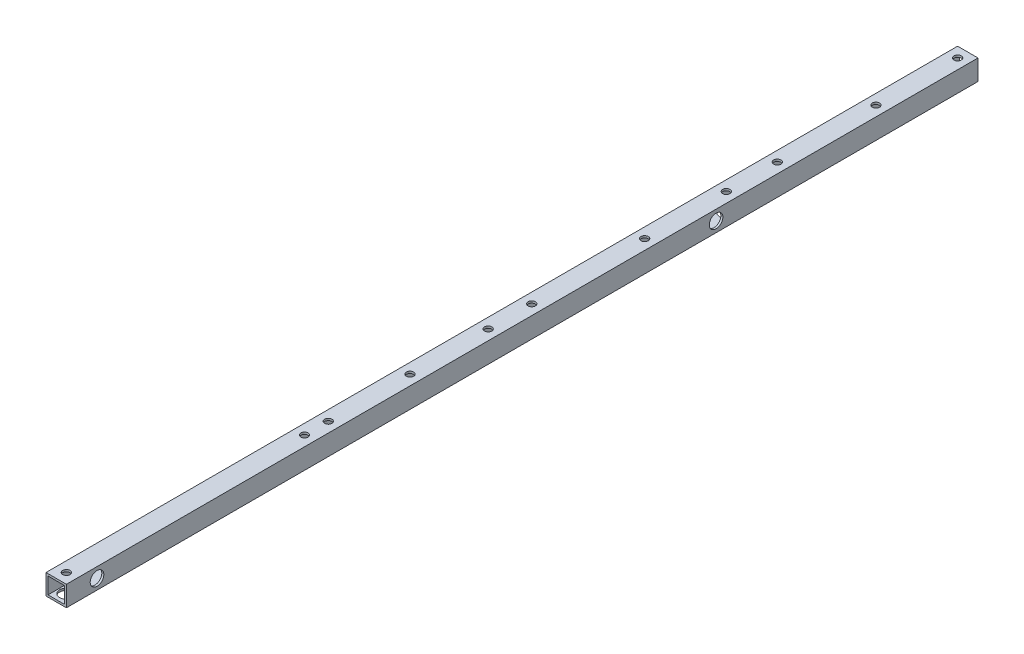
ISO-10303-21;
HEADER;
FILE_DESCRIPTION(('STEP AP214'),'2;1');
FILE_NAME('part.step','',(''),(''),'','','');
FILE_SCHEMA(('AUTOMOTIVE_DESIGN { 1 0 10303 214 1 1 1 1 }'));
ENDSEC;
DATA;
#1=APPLICATION_CONTEXT('core data for automotive mechanical design processes');
#2=APPLICATION_PROTOCOL_DEFINITION('international standard','automotive_design',2000,#1);
#3=PRODUCT_CONTEXT('',#1,'mechanical');
#4=PRODUCT('Part','Part','',(#3));
#5=PRODUCT_RELATED_PRODUCT_CATEGORY('part','',(#4));
#6=PRODUCT_DEFINITION_FORMATION('','',#4);
#7=PRODUCT_DEFINITION_CONTEXT('part definition',#1,'design');
#8=PRODUCT_DEFINITION('design','',#6,#7);
#9=PRODUCT_DEFINITION_SHAPE('','',#8);
#10=(LENGTH_UNIT() NAMED_UNIT(*) SI_UNIT(.MILLI.,.METRE.));
#11=(NAMED_UNIT(*) PLANE_ANGLE_UNIT() SI_UNIT($,.RADIAN.));
#12=(NAMED_UNIT(*) SI_UNIT($,.STERADIAN.) SOLID_ANGLE_UNIT());
#13=UNCERTAINTY_MEASURE_WITH_UNIT(LENGTH_MEASURE(1.E-05),#10,'distance_accuracy_value','');
#14=(GEOMETRIC_REPRESENTATION_CONTEXT(3) GLOBAL_UNCERTAINTY_ASSIGNED_CONTEXT((#13)) GLOBAL_UNIT_ASSIGNED_CONTEXT((#10,
#11,#12)) REPRESENTATION_CONTEXT('',''));
#15=CARTESIAN_POINT('',(0.,0.,0.));
#16=DIRECTION('',(0.,0.,1.));
#17=DIRECTION('',(1.,0.,0.));
#18=AXIS2_PLACEMENT_3D('',#15,#16,#17);
#19=CARTESIAN_POINT('',(-6.,-6.,670.));
#20=DIRECTION('',(0.,1.,0.));
#21=DIRECTION('',(0.,0.,1.));
#22=AXIS2_PLACEMENT_3D('',#19,#20,#21);
#23=PLANE('',#22);
#24=DIRECTION('',(1.,0.,0.));
#25=VECTOR('',#24,1.);
#26=CARTESIAN_POINT('',(-6.,-6.,0.));
#27=LINE('',#26,#25);
#28=CARTESIAN_POINT('',(-6.,-6.,0.));
#29=VERTEX_POINT('',#28);
#30=CARTESIAN_POINT('',(6.,-6.,0.));
#31=VERTEX_POINT('',#30);
#32=EDGE_CURVE('E117',#29,#31,#27,.T.);
#33=ORIENTED_EDGE('',*,*,#32,.F.);
#34=DIRECTION('',(0.,0.,-1.));
#35=VECTOR('',#34,1.);
#36=CARTESIAN_POINT('',(-6.,-6.,670.));
#37=LINE('',#36,#35);
#38=CARTESIAN_POINT('',(-6.,-6.,670.));
#39=VERTEX_POINT('',#38);
#40=EDGE_CURVE('E58',#39,#29,#37,.T.);
#41=ORIENTED_EDGE('',*,*,#40,.F.);
#42=DIRECTION('',(1.,0.,0.));
#43=VECTOR('',#42,1.);
#44=CARTESIAN_POINT('',(-6.,-6.,670.));
#45=LINE('',#44,#43);
#46=CARTESIAN_POINT('',(6.,-6.,670.));
#47=VERTEX_POINT('',#46);
#48=EDGE_CURVE('E131',#39,#47,#45,.T.);
#49=ORIENTED_EDGE('',*,*,#48,.T.);
#50=DIRECTION('',(0.,0.,-1.));
#51=VECTOR('',#50,1.);
#52=CARTESIAN_POINT('',(6.,-6.,670.));
#53=LINE('',#52,#51);
#54=EDGE_CURVE('E112',#47,#31,#53,.T.);
#55=ORIENTED_EDGE('',*,*,#54,.T.);
#56=EDGE_LOOP('',(#33,#41,#49,#55));
#57=FACE_BOUND('',#56,.T.);
#58=CARTESIAN_POINT('',(1.50911831337965E-12,-6.,67.4999999999999));
#59=DIRECTION('',(0.,1.,0.));
#60=DIRECTION('',(0.,0.,1.));
#61=AXIS2_PLACEMENT_3D('',#58,#59,#60);
#62=CIRCLE('',#61,5.);
#63=CARTESIAN_POINT('',(1.50911831337965E-12,-6.,72.5));
#64=VERTEX_POINT('',#63);
#65=EDGE_CURVE('E180',#64,#64,#62,.T.);
#66=ORIENTED_EDGE('',*,*,#65,.F.);
#67=EDGE_LOOP('',(#66));
#68=FACE_BOUND('',#67,.T.);
#69=CARTESIAN_POINT('',(0.,-6.,487.5));
#70=DIRECTION('',(0.,1.,0.));
#71=DIRECTION('',(0.,0.,1.));
#72=AXIS2_PLACEMENT_3D('',#69,#70,#71);
#73=CIRCLE('',#72,5.00000000000001);
#74=CARTESIAN_POINT('',(0.,-6.,492.5));
#75=VERTEX_POINT('',#74);
#76=EDGE_CURVE('E183',#75,#75,#73,.T.);
#77=ORIENTED_EDGE('',*,*,#76,.F.);
#78=EDGE_LOOP('',(#77));
#79=FACE_BOUND('',#78,.T.);
#80=CARTESIAN_POINT('',(-4.63083614849579E-13,-6.,352.5));
#81=DIRECTION('',(0.,1.,0.));
#82=DIRECTION('',(0.,0.,1.));
#83=AXIS2_PLACEMENT_3D('',#80,#81,#82);
#84=CIRCLE('',#83,5.00000000000001);
#85=CARTESIAN_POINT('',(-4.63083614849579E-13,-6.,357.5));
#86=VERTEX_POINT('',#85);
#87=EDGE_CURVE('E187',#86,#86,#84,.T.);
#88=ORIENTED_EDGE('',*,*,#87,.F.);
#89=EDGE_LOOP('',(#88));
#90=FACE_BOUND('',#89,.T.);
#91=CARTESIAN_POINT('',(0.,-6.,177.5));
#92=DIRECTION('',(0.,1.,0.));
#93=DIRECTION('',(0.,0.,1.));
#94=AXIS2_PLACEMENT_3D('',#91,#92,#93);
#95=CIRCLE('',#94,5.00000000000001);
#96=CARTESIAN_POINT('',(0.,-6.,182.5));
#97=VERTEX_POINT('',#96);
#98=EDGE_CURVE('E190',#97,#97,#95,.T.);
#99=ORIENTED_EDGE('',*,*,#98,.F.);
#100=EDGE_LOOP('',(#99));
#101=FACE_BOUND('',#100,.T.);
#102=CARTESIAN_POINT('',(4.19131769982024E-12,-6.,470.));
#103=DIRECTION('',(0.,1.,0.));
#104=DIRECTION('',(0.,0.,1.));
#105=AXIS2_PLACEMENT_3D('',#102,#103,#104);
#106=CIRCLE('',#105,5.);
#107=CARTESIAN_POINT('',(4.19131769982024E-12,-6.,475.));
#108=VERTEX_POINT('',#107);
#109=EDGE_CURVE('E193',#108,#108,#106,.T.);
#110=ORIENTED_EDGE('',*,*,#109,.F.);
#111=EDGE_LOOP('',(#110));
#112=FACE_BOUND('',#111,.T.);
#113=CARTESIAN_POINT('',(4.19131769982024E-12,-6.,410.));
#114=DIRECTION('',(0.,1.,0.));
#115=DIRECTION('',(0.,0.,1.));
#116=AXIS2_PLACEMENT_3D('',#113,#114,#115);
#117=CIRCLE('',#116,5.);
#118=CARTESIAN_POINT('',(4.19131769982024E-12,-6.,415.));
#119=VERTEX_POINT('',#118);
#120=EDGE_CURVE('E196',#119,#119,#117,.T.);
#121=ORIENTED_EDGE('',*,*,#120,.F.);
#122=EDGE_LOOP('',(#121));
#123=FACE_BOUND('',#122,.T.);
#124=CARTESIAN_POINT('',(-3.10649990647104E-12,-6.,7.50000000000001));
#125=DIRECTION('',(0.,1.,0.));
#126=DIRECTION('',(0.,0.,1.));
#127=AXIS2_PLACEMENT_3D('',#124,#125,#126);
#128=CIRCLE('',#127,5.);
#129=CARTESIAN_POINT('',(-3.10649990647104E-12,-6.,12.5));
#130=VERTEX_POINT('',#129);
#131=EDGE_CURVE('E199',#130,#130,#128,.T.);
#132=ORIENTED_EDGE('',*,*,#131,.F.);
#133=EDGE_LOOP('',(#132));
#134=FACE_BOUND('',#133,.T.);
#135=CARTESIAN_POINT('',(0.,-6.,140.));
#136=DIRECTION('',(0.,1.,0.));
#137=DIRECTION('',(0.,0.,1.));
#138=AXIS2_PLACEMENT_3D('',#135,#136,#137);
#139=CIRCLE('',#138,5.);
#140=CARTESIAN_POINT('',(0.,-6.,145.));
#141=VERTEX_POINT('',#140);
#142=EDGE_CURVE('E202',#141,#141,#139,.T.);
#143=ORIENTED_EDGE('',*,*,#142,.F.);
#144=EDGE_LOOP('',(#143));
#145=FACE_BOUND('',#144,.T.);
#146=CARTESIAN_POINT('',(0.,-6.,662.5));
#147=DIRECTION('',(0.,1.,0.));
#148=DIRECTION('',(0.,0.,1.));
#149=AXIS2_PLACEMENT_3D('',#146,#147,#148);
#150=CIRCLE('',#149,5.00000000000001);
#151=CARTESIAN_POINT('',(0.,-6.,667.5));
#152=VERTEX_POINT('',#151);
#153=EDGE_CURVE('E205',#152,#152,#150,.T.);
#154=ORIENTED_EDGE('',*,*,#153,.F.);
#155=EDGE_LOOP('',(#154));
#156=FACE_BOUND('',#155,.T.);
#157=CARTESIAN_POINT('',(0.,-6.,320.5));
#158=DIRECTION('',(0.,1.,0.));
#159=DIRECTION('',(0.,0.,1.));
#160=AXIS2_PLACEMENT_3D('',#157,#158,#159);
#161=CIRCLE('',#160,4.99999999999999);
#162=CARTESIAN_POINT('',(0.,-6.,325.5));
#163=VERTEX_POINT('',#162);
#164=EDGE_CURVE('E500',#163,#163,#161,.F.);
#165=ORIENTED_EDGE('',*,*,#164,.T.);
#166=EDGE_LOOP('',(#165));
#167=FACE_BOUND('',#166,.T.);
#168=CARTESIAN_POINT('',(0.,-6.,237.5));
#169=DIRECTION('',(0.,1.,0.));
#170=DIRECTION('',(0.,0.,1.));
#171=AXIS2_PLACEMENT_3D('',#168,#169,#170);
#172=CIRCLE('',#171,4.99999999999999);
#173=CARTESIAN_POINT('',(0.,-6.,242.5));
#174=VERTEX_POINT('',#173);
#175=EDGE_CURVE('E490',#174,#174,#172,.F.);
#176=ORIENTED_EDGE('',*,*,#175,.T.);
#177=EDGE_LOOP('',(#176));
#178=FACE_BOUND('',#177,.T.);
#179=ADVANCED_FACE('F41',(#57,#68,#79,#90,#101,#112,#123,#134,#145,#156,#167,#178),#23,.T.);
#180=CARTESIAN_POINT('',(0.,0.,670.));
#181=DIRECTION('',(0.,0.,-1.));
#182=DIRECTION('',(-1.,0.,0.));
#183=AXIS2_PLACEMENT_3D('',#180,#181,#182);
#184=PLANE('',#183);
#185=DIRECTION('',(0.,1.,0.));
#186=VECTOR('',#185,1.);
#187=CARTESIAN_POINT('',(7.5,-7.5,670.));
#188=LINE('',#187,#186);
#189=CARTESIAN_POINT('',(7.5,-7.5,670.));
#190=VERTEX_POINT('',#189);
#191=CARTESIAN_POINT('',(7.5,7.5,670.));
#192=VERTEX_POINT('',#191);
#193=EDGE_CURVE('E147',#190,#192,#188,.T.);
#194=ORIENTED_EDGE('',*,*,#193,.T.);
#195=DIRECTION('',(-1.,0.,0.));
#196=VECTOR('',#195,1.);
#197=CARTESIAN_POINT('',(-7.5,7.5,670.));
#198=LINE('',#197,#196);
#199=CARTESIAN_POINT('',(-7.5,7.5,670.));
#200=VERTEX_POINT('',#199);
#201=EDGE_CURVE('E150',#192,#200,#198,.T.);
#202=ORIENTED_EDGE('',*,*,#201,.T.);
#203=DIRECTION('',(0.,-1.,0.));
#204=VECTOR('',#203,1.);
#205=CARTESIAN_POINT('',(-7.5,-7.5,670.));
#206=LINE('',#205,#204);
#207=CARTESIAN_POINT('',(-7.5,-7.5,670.));
#208=VERTEX_POINT('',#207);
#209=EDGE_CURVE('E153',#200,#208,#206,.T.);
#210=ORIENTED_EDGE('',*,*,#209,.T.);
#211=DIRECTION('',(1.,0.,0.));
#212=VECTOR('',#211,1.);
#213=CARTESIAN_POINT('',(-7.5,-7.5,670.));
#214=LINE('',#213,#212);
#215=EDGE_CURVE('E155',#208,#190,#214,.T.);
#216=ORIENTED_EDGE('',*,*,#215,.T.);
#217=EDGE_LOOP('',(#194,#202,#210,#216));
#218=FACE_BOUND('',#217,.T.);
#219=DIRECTION('',(0.,1.,0.));
#220=VECTOR('',#219,1.);
#221=CARTESIAN_POINT('',(6.,-6.,670.));
#222=LINE('',#221,#220);
#223=CARTESIAN_POINT('',(6.,6.,670.));
#224=VERTEX_POINT('',#223);
#225=EDGE_CURVE('E108',#47,#224,#222,.T.);
#226=ORIENTED_EDGE('',*,*,#225,.F.);
#227=ORIENTED_EDGE('',*,*,#48,.F.);
#228=DIRECTION('',(0.,-1.,0.));
#229=VECTOR('',#228,1.);
#230=CARTESIAN_POINT('',(-6.,-6.,670.));
#231=LINE('',#230,#229);
#232=CARTESIAN_POINT('',(-6.,6.,670.));
#233=VERTEX_POINT('',#232);
#234=EDGE_CURVE('E129',#233,#39,#231,.T.);
#235=ORIENTED_EDGE('',*,*,#234,.F.);
#236=DIRECTION('',(-1.,0.,0.));
#237=VECTOR('',#236,1.);
#238=CARTESIAN_POINT('',(-6.,6.,670.));
#239=LINE('',#238,#237);
#240=EDGE_CURVE('E116',#224,#233,#239,.T.);
#241=ORIENTED_EDGE('',*,*,#240,.F.);
#242=EDGE_LOOP('',(#226,#227,#235,#241));
#243=FACE_BOUND('',#242,.T.);
#244=ADVANCED_FACE('F128',(#218,#243),#184,.F.);
#245=CARTESIAN_POINT('',(0.,0.,0.));
#246=DIRECTION('',(0.,0.,-1.));
#247=DIRECTION('',(-1.,0.,0.));
#248=AXIS2_PLACEMENT_3D('',#245,#246,#247);
#249=PLANE('',#248);
#250=DIRECTION('',(0.,1.,0.));
#251=VECTOR('',#250,1.);
#252=CARTESIAN_POINT('',(7.5,-7.5,0.));
#253=LINE('',#252,#251);
#254=CARTESIAN_POINT('',(7.5,-7.5,0.));
#255=VERTEX_POINT('',#254);
#256=CARTESIAN_POINT('',(7.5,7.5,0.));
#257=VERTEX_POINT('',#256);
#258=EDGE_CURVE('E124',#255,#257,#253,.T.);
#259=ORIENTED_EDGE('',*,*,#258,.F.);
#260=DIRECTION('',(1.,0.,0.));
#261=VECTOR('',#260,1.);
#262=CARTESIAN_POINT('',(-7.5,-7.5,0.));
#263=LINE('',#262,#261);
#264=CARTESIAN_POINT('',(-7.5,-7.5,0.));
#265=VERTEX_POINT('',#264);
#266=EDGE_CURVE('E151',#265,#255,#263,.T.);
#267=ORIENTED_EDGE('',*,*,#266,.F.);
#268=DIRECTION('',(0.,-1.,0.));
#269=VECTOR('',#268,1.);
#270=CARTESIAN_POINT('',(-7.5,-7.5,0.));
#271=LINE('',#270,#269);
#272=CARTESIAN_POINT('',(-7.5,7.5,0.));
#273=VERTEX_POINT('',#272);
#274=EDGE_CURVE('E162',#273,#265,#271,.T.);
#275=ORIENTED_EDGE('',*,*,#274,.F.);
#276=DIRECTION('',(-1.,0.,0.));
#277=VECTOR('',#276,1.);
#278=CARTESIAN_POINT('',(-7.5,7.5,0.));
#279=LINE('',#278,#277);
#280=EDGE_CURVE('E160',#257,#273,#279,.T.);
#281=ORIENTED_EDGE('',*,*,#280,.F.);
#282=EDGE_LOOP('',(#259,#267,#275,#281));
#283=FACE_BOUND('',#282,.T.);
#284=ORIENTED_EDGE('',*,*,#32,.T.);
#285=DIRECTION('',(0.,1.,0.));
#286=VECTOR('',#285,1.);
#287=CARTESIAN_POINT('',(6.,-6.,0.));
#288=LINE('',#287,#286);
#289=CARTESIAN_POINT('',(6.,6.,0.));
#290=VERTEX_POINT('',#289);
#291=EDGE_CURVE('E66',#31,#290,#288,.T.);
#292=ORIENTED_EDGE('',*,*,#291,.T.);
#293=DIRECTION('',(-1.,0.,0.));
#294=VECTOR('',#293,1.);
#295=CARTESIAN_POINT('',(-6.,6.,0.));
#296=LINE('',#295,#294);
#297=CARTESIAN_POINT('',(-6.,6.,0.));
#298=VERTEX_POINT('',#297);
#299=EDGE_CURVE('E123',#290,#298,#296,.T.);
#300=ORIENTED_EDGE('',*,*,#299,.T.);
#301=DIRECTION('',(0.,-1.,0.));
#302=VECTOR('',#301,1.);
#303=CARTESIAN_POINT('',(-6.,-6.,0.));
#304=LINE('',#303,#302);
#305=EDGE_CURVE('E139',#298,#29,#304,.T.);
#306=ORIENTED_EDGE('',*,*,#305,.T.);
#307=EDGE_LOOP('',(#284,#292,#300,#306));
#308=FACE_BOUND('',#307,.T.);
#309=ADVANCED_FACE('F323',(#283,#308),#249,.T.);
#310=CARTESIAN_POINT('',(7.5,-7.5,670.));
#311=DIRECTION('',(-1.,0.,0.));
#312=DIRECTION('',(0.,0.,1.));
#313=AXIS2_PLACEMENT_3D('',#310,#311,#312);
#314=PLANE('',#313);
#315=CARTESIAN_POINT('',(7.5,0.,647.5));
#316=DIRECTION('',(1.,0.,0.));
#317=DIRECTION('',(0.,0.,-1.));
#318=AXIS2_PLACEMENT_3D('',#315,#316,#317);
#319=CIRCLE('',#318,5.00000000000004);
#320=CARTESIAN_POINT('',(7.5,0.,642.5));
#321=VERTEX_POINT('',#320);
#322=EDGE_CURVE('E212',#321,#321,#319,.T.);
#323=ORIENTED_EDGE('',*,*,#322,.F.);
#324=EDGE_LOOP('',(#323));
#325=FACE_BOUND('',#324,.T.);
#326=CARTESIAN_POINT('',(7.5,0.,192.5));
#327=DIRECTION('',(1.,0.,0.));
#328=DIRECTION('',(0.,0.,-1.));
#329=AXIS2_PLACEMENT_3D('',#326,#327,#328);
#330=CIRCLE('',#329,4.99999999999999);
#331=CARTESIAN_POINT('',(7.5,0.,187.5));
#332=VERTEX_POINT('',#331);
#333=EDGE_CURVE('E510',#332,#332,#330,.T.);
#334=ORIENTED_EDGE('',*,*,#333,.F.);
#335=EDGE_LOOP('',(#334));
#336=FACE_BOUND('',#335,.T.);
#337=ORIENTED_EDGE('',*,*,#258,.T.);
#338=DIRECTION('',(0.,0.,-1.));
#339=VECTOR('',#338,1.);
#340=CARTESIAN_POINT('',(7.5,7.5,670.));
#341=LINE('',#340,#339);
#342=EDGE_CURVE('E11',#192,#257,#341,.T.);
#343=ORIENTED_EDGE('',*,*,#342,.F.);
#344=ORIENTED_EDGE('',*,*,#193,.F.);
#345=DIRECTION('',(0.,0.,-1.));
#346=VECTOR('',#345,1.);
#347=CARTESIAN_POINT('',(7.5,-7.5,670.));
#348=LINE('',#347,#346);
#349=EDGE_CURVE('E157',#190,#255,#348,.T.);
#350=ORIENTED_EDGE('',*,*,#349,.T.);
#351=EDGE_LOOP('',(#337,#343,#344,#350));
#352=FACE_BOUND('',#351,.T.);
#353=ADVANCED_FACE('F43',(#325,#336,#352),#314,.F.);
#354=CARTESIAN_POINT('',(-7.5,7.5,670.));
#355=DIRECTION('',(0.,-1.,0.));
#356=DIRECTION('',(0.,0.,-1.));
#357=AXIS2_PLACEMENT_3D('',#354,#355,#356);
#358=PLANE('',#357);
#359=CARTESIAN_POINT('',(0.,7.5,237.5));
#360=DIRECTION('',(0.,1.,0.));
#361=DIRECTION('',(0.,0.,1.));
#362=AXIS2_PLACEMENT_3D('',#359,#360,#361);
#363=CIRCLE('',#362,2.7);
#364=CARTESIAN_POINT('',(0.,7.5,240.2));
#365=VERTEX_POINT('',#364);
#366=EDGE_CURVE('E355',#365,#365,#363,.T.);
#367=ORIENTED_EDGE('',*,*,#366,.F.);
#368=EDGE_LOOP('',(#367));
#369=FACE_BOUND('',#368,.T.);
#370=CARTESIAN_POINT('',(0.,7.5,320.5));
#371=DIRECTION('',(0.,1.,0.));
#372=DIRECTION('',(0.,0.,1.));
#373=AXIS2_PLACEMENT_3D('',#370,#371,#372);
#374=CIRCLE('',#373,2.7);
#375=CARTESIAN_POINT('',(0.,7.5,323.2));
#376=VERTEX_POINT('',#375);
#377=EDGE_CURVE('E359',#376,#376,#374,.T.);
#378=ORIENTED_EDGE('',*,*,#377,.F.);
#379=EDGE_LOOP('',(#378));
#380=FACE_BOUND('',#379,.T.);
#381=CARTESIAN_POINT('',(0.,7.5,7.5));
#382=DIRECTION('',(0.,1.,0.));
#383=DIRECTION('',(0.,0.,1.));
#384=AXIS2_PLACEMENT_3D('',#381,#382,#383);
#385=CIRCLE('',#384,2.7);
#386=CARTESIAN_POINT('',(0.,7.5,10.2));
#387=VERTEX_POINT('',#386);
#388=EDGE_CURVE('E240',#387,#387,#385,.T.);
#389=ORIENTED_EDGE('',*,*,#388,.F.);
#390=EDGE_LOOP('',(#389));
#391=FACE_BOUND('',#390,.T.);
#392=CARTESIAN_POINT('',(0.,7.5,67.4999999999999));
#393=DIRECTION('',(0.,1.,0.));
#394=DIRECTION('',(0.,0.,1.));
#395=AXIS2_PLACEMENT_3D('',#392,#393,#394);
#396=CIRCLE('',#395,2.7);
#397=CARTESIAN_POINT('',(0.,7.5,70.1999999999999));
#398=VERTEX_POINT('',#397);
#399=EDGE_CURVE('E244',#398,#398,#396,.T.);
#400=ORIENTED_EDGE('',*,*,#399,.F.);
#401=EDGE_LOOP('',(#400));
#402=FACE_BOUND('',#401,.T.);
#403=CARTESIAN_POINT('',(4.19131769982024E-12,7.5,410.));
#404=DIRECTION('',(0.,1.,0.));
#405=DIRECTION('',(0.,0.,1.));
#406=AXIS2_PLACEMENT_3D('',#403,#404,#405);
#407=CIRCLE('',#406,2.69999999999999);
#408=CARTESIAN_POINT('',(4.19131769982024E-12,7.5,412.7));
#409=VERTEX_POINT('',#408);
#410=EDGE_CURVE('E247',#409,#409,#407,.T.);
#411=ORIENTED_EDGE('',*,*,#410,.F.);
#412=EDGE_LOOP('',(#411));
#413=FACE_BOUND('',#412,.T.);
#414=CARTESIAN_POINT('',(4.19131769982024E-12,7.5,470.));
#415=DIRECTION('',(0.,1.,0.));
#416=DIRECTION('',(0.,0.,1.));
#417=AXIS2_PLACEMENT_3D('',#414,#415,#416);
#418=CIRCLE('',#417,2.69999999999999);
#419=CARTESIAN_POINT('',(4.19131769982024E-12,7.5,472.7));
#420=VERTEX_POINT('',#419);
#421=EDGE_CURVE('E208',#420,#420,#418,.T.);
#422=ORIENTED_EDGE('',*,*,#421,.F.);
#423=EDGE_LOOP('',(#422));
#424=FACE_BOUND('',#423,.T.);
#425=CARTESIAN_POINT('',(0.,7.5,662.5));
#426=DIRECTION('',(0.,1.,0.));
#427=DIRECTION('',(0.,0.,1.));
#428=AXIS2_PLACEMENT_3D('',#425,#426,#427);
#429=CIRCLE('',#428,2.69999999999998);
#430=CARTESIAN_POINT('',(0.,7.5,665.2));
#431=VERTEX_POINT('',#430);
#432=EDGE_CURVE('E264',#431,#431,#429,.T.);
#433=ORIENTED_EDGE('',*,*,#432,.F.);
#434=EDGE_LOOP('',(#433));
#435=FACE_BOUND('',#434,.T.);
#436=CARTESIAN_POINT('',(0.,7.5,487.5));
#437=DIRECTION('',(0.,1.,0.));
#438=DIRECTION('',(0.,0.,1.));
#439=AXIS2_PLACEMENT_3D('',#436,#437,#438);
#440=CIRCLE('',#439,2.69999999999998);
#441=CARTESIAN_POINT('',(0.,7.5,490.2));
#442=VERTEX_POINT('',#441);
#443=EDGE_CURVE('E263',#442,#442,#440,.T.);
#444=ORIENTED_EDGE('',*,*,#443,.F.);
#445=EDGE_LOOP('',(#444));
#446=FACE_BOUND('',#445,.T.);
#447=CARTESIAN_POINT('',(0.,7.5,140.));
#448=DIRECTION('',(0.,1.,0.));
#449=DIRECTION('',(0.,0.,1.));
#450=AXIS2_PLACEMENT_3D('',#447,#448,#449);
#451=CIRCLE('',#450,2.70000000000001);
#452=CARTESIAN_POINT('',(0.,7.5,142.7));
#453=VERTEX_POINT('',#452);
#454=EDGE_CURVE('E269',#453,#453,#451,.T.);
#455=ORIENTED_EDGE('',*,*,#454,.F.);
#456=EDGE_LOOP('',(#455));
#457=FACE_BOUND('',#456,.T.);
#458=CARTESIAN_POINT('',(0.,7.5,177.5));
#459=DIRECTION('',(0.,1.,0.));
#460=DIRECTION('',(0.,0.,1.));
#461=AXIS2_PLACEMENT_3D('',#458,#459,#460);
#462=CIRCLE('',#461,2.70000000000001);
#463=CARTESIAN_POINT('',(0.,7.5,180.2));
#464=VERTEX_POINT('',#463);
#465=EDGE_CURVE('E272',#464,#464,#462,.T.);
#466=ORIENTED_EDGE('',*,*,#465,.F.);
#467=EDGE_LOOP('',(#466));
#468=FACE_BOUND('',#467,.T.);
#469=CARTESIAN_POINT('',(-4.63083614849579E-13,7.5,352.5));
#470=DIRECTION('',(0.,1.,0.));
#471=DIRECTION('',(0.,0.,1.));
#472=AXIS2_PLACEMENT_3D('',#469,#470,#471);
#473=CIRCLE('',#472,2.69999999999998);
#474=CARTESIAN_POINT('',(-4.63083614849579E-13,7.5,355.2));
#475=VERTEX_POINT('',#474);
#476=EDGE_CURVE('E268',#475,#475,#473,.T.);
#477=ORIENTED_EDGE('',*,*,#476,.F.);
#478=EDGE_LOOP('',(#477));
#479=FACE_BOUND('',#478,.T.);
#480=ORIENTED_EDGE('',*,*,#280,.T.);
#481=DIRECTION('',(0.,0.,-1.));
#482=VECTOR('',#481,1.);
#483=CARTESIAN_POINT('',(-7.5,7.5,670.));
#484=LINE('',#483,#482);
#485=EDGE_CURVE('E50',#200,#273,#484,.T.);
#486=ORIENTED_EDGE('',*,*,#485,.F.);
#487=ORIENTED_EDGE('',*,*,#201,.F.);
#488=ORIENTED_EDGE('',*,*,#342,.T.);
#489=EDGE_LOOP('',(#480,#486,#487,#488));
#490=FACE_BOUND('',#489,.T.);
#491=ADVANCED_FACE('F344',(#369,#380,#391,#402,#413,#424,#435,#446,#457,#468,#479,#490),#358,.F.);
#492=CARTESIAN_POINT('',(-7.5,-7.5,670.));
#493=DIRECTION('',(1.,0.,0.));
#494=DIRECTION('',(0.,0.,-1.));
#495=AXIS2_PLACEMENT_3D('',#492,#493,#494);
#496=PLANE('',#495);
#497=CARTESIAN_POINT('',(-7.5,0.,647.5));
#498=DIRECTION('',(1.,0.,0.));
#499=DIRECTION('',(0.,0.,-1.));
#500=AXIS2_PLACEMENT_3D('',#497,#498,#499);
#501=CIRCLE('',#500,2.70000000000001);
#502=CARTESIAN_POINT('',(-7.5,0.,644.8));
#503=VERTEX_POINT('',#502);
#504=EDGE_CURVE('E137',#503,#503,#501,.T.);
#505=ORIENTED_EDGE('',*,*,#504,.T.);
#506=EDGE_LOOP('',(#505));
#507=FACE_BOUND('',#506,.T.);
#508=CARTESIAN_POINT('',(-7.5,0.,192.5));
#509=DIRECTION('',(1.,0.,0.));
#510=DIRECTION('',(0.,0.,-1.));
#511=AXIS2_PLACEMENT_3D('',#508,#509,#510);
#512=CIRCLE('',#511,2.69999999999995);
#513=CARTESIAN_POINT('',(-7.5,0.,189.8));
#514=VERTEX_POINT('',#513);
#515=EDGE_CURVE('E175',#514,#514,#512,.T.);
#516=ORIENTED_EDGE('',*,*,#515,.T.);
#517=EDGE_LOOP('',(#516));
#518=FACE_BOUND('',#517,.T.);
#519=ORIENTED_EDGE('',*,*,#274,.T.);
#520=DIRECTION('',(0.,0.,-1.));
#521=VECTOR('',#520,1.);
#522=CARTESIAN_POINT('',(-7.5,-7.5,670.));
#523=LINE('',#522,#521);
#524=EDGE_CURVE('E167',#208,#265,#523,.T.);
#525=ORIENTED_EDGE('',*,*,#524,.F.);
#526=ORIENTED_EDGE('',*,*,#209,.F.);
#527=ORIENTED_EDGE('',*,*,#485,.T.);
#528=EDGE_LOOP('',(#519,#525,#526,#527));
#529=FACE_BOUND('',#528,.T.);
#530=ADVANCED_FACE('F296',(#507,#518,#529),#496,.F.);
#531=CARTESIAN_POINT('',(-7.5,-7.5,670.));
#532=DIRECTION('',(0.,1.,0.));
#533=DIRECTION('',(0.,0.,1.));
#534=AXIS2_PLACEMENT_3D('',#531,#532,#533);
#535=PLANE('',#534);
#536=CARTESIAN_POINT('',(0.,-7.5,237.5));
#537=DIRECTION('',(0.,-1.,0.));
#538=DIRECTION('',(0.,0.,-1.));
#539=AXIS2_PLACEMENT_3D('',#536,#537,#538);
#540=CIRCLE('',#539,4.99999999999999);
#541=CARTESIAN_POINT('',(0.,-7.5,232.5));
#542=VERTEX_POINT('',#541);
#543=EDGE_CURVE('E493',#542,#542,#540,.T.);
#544=ORIENTED_EDGE('',*,*,#543,.F.);
#545=EDGE_LOOP('',(#544));
#546=FACE_BOUND('',#545,.T.);
#547=CARTESIAN_POINT('',(0.,-7.5,320.5));
#548=DIRECTION('',(0.,-1.,0.));
#549=DIRECTION('',(0.,0.,-1.));
#550=AXIS2_PLACEMENT_3D('',#547,#548,#549);
#551=CIRCLE('',#550,4.99999999999999);
#552=CARTESIAN_POINT('',(0.,-7.5,315.5));
#553=VERTEX_POINT('',#552);
#554=EDGE_CURVE('E495',#553,#553,#551,.T.);
#555=ORIENTED_EDGE('',*,*,#554,.F.);
#556=EDGE_LOOP('',(#555));
#557=FACE_BOUND('',#556,.T.);
#558=CARTESIAN_POINT('',(0.,-7.5,662.5));
#559=DIRECTION('',(0.,-1.,0.));
#560=DIRECTION('',(0.,0.,-1.));
#561=AXIS2_PLACEMENT_3D('',#558,#559,#560);
#562=CIRCLE('',#561,5.00000000000001);
#563=CARTESIAN_POINT('',(0.,-7.5,657.5));
#564=VERTEX_POINT('',#563);
#565=EDGE_CURVE('E184',#564,#564,#562,.T.);
#566=ORIENTED_EDGE('',*,*,#565,.F.);
#567=EDGE_LOOP('',(#566));
#568=FACE_BOUND('',#567,.T.);
#569=CARTESIAN_POINT('',(0.,-7.5,140.));
#570=DIRECTION('',(0.,-1.,0.));
#571=DIRECTION('',(0.,0.,-1.));
#572=AXIS2_PLACEMENT_3D('',#569,#570,#571);
#573=CIRCLE('',#572,5.);
#574=CARTESIAN_POINT('',(0.,-7.5,135.));
#575=VERTEX_POINT('',#574);
#576=EDGE_CURVE('E214',#575,#575,#573,.T.);
#577=ORIENTED_EDGE('',*,*,#576,.F.);
#578=EDGE_LOOP('',(#577));
#579=FACE_BOUND('',#578,.T.);
#580=CARTESIAN_POINT('',(-3.10649990647104E-12,-7.5,7.50000000000001));
#581=DIRECTION('',(0.,-1.,0.));
#582=DIRECTION('',(0.,0.,-1.));
#583=AXIS2_PLACEMENT_3D('',#580,#581,#582);
#584=CIRCLE('',#583,5.);
#585=CARTESIAN_POINT('',(-3.10649990647104E-12,-7.5,2.50000000000001));
#586=VERTEX_POINT('',#585);
#587=EDGE_CURVE('E218',#586,#586,#584,.T.);
#588=ORIENTED_EDGE('',*,*,#587,.F.);
#589=EDGE_LOOP('',(#588));
#590=FACE_BOUND('',#589,.T.);
#591=CARTESIAN_POINT('',(4.19131769982024E-12,-7.5,410.));
#592=DIRECTION('',(0.,-1.,0.));
#593=DIRECTION('',(0.,0.,-1.));
#594=AXIS2_PLACEMENT_3D('',#591,#592,#593);
#595=CIRCLE('',#594,5.);
#596=CARTESIAN_POINT('',(4.19131769982024E-12,-7.5,405.));
#597=VERTEX_POINT('',#596);
#598=EDGE_CURVE('E223',#597,#597,#595,.T.);
#599=ORIENTED_EDGE('',*,*,#598,.F.);
#600=EDGE_LOOP('',(#599));
#601=FACE_BOUND('',#600,.T.);
#602=CARTESIAN_POINT('',(4.19131769982024E-12,-7.5,470.));
#603=DIRECTION('',(0.,-1.,0.));
#604=DIRECTION('',(0.,0.,-1.));
#605=AXIS2_PLACEMENT_3D('',#602,#603,#604);
#606=CIRCLE('',#605,5.);
#607=CARTESIAN_POINT('',(4.19131769982024E-12,-7.5,465.));
#608=VERTEX_POINT('',#607);
#609=EDGE_CURVE('E234',#608,#608,#606,.T.);
#610=ORIENTED_EDGE('',*,*,#609,.F.);
#611=EDGE_LOOP('',(#610));
#612=FACE_BOUND('',#611,.T.);
#613=CARTESIAN_POINT('',(0.,-7.5,177.5));
#614=DIRECTION('',(0.,-1.,0.));
#615=DIRECTION('',(0.,0.,-1.));
#616=AXIS2_PLACEMENT_3D('',#613,#614,#615);
#617=CIRCLE('',#616,5.00000000000001);
#618=CARTESIAN_POINT('',(0.,-7.5,172.5));
#619=VERTEX_POINT('',#618);
#620=EDGE_CURVE('E235',#619,#619,#617,.T.);
#621=ORIENTED_EDGE('',*,*,#620,.F.);
#622=EDGE_LOOP('',(#621));
#623=FACE_BOUND('',#622,.T.);
#624=CARTESIAN_POINT('',(-4.63083614849579E-13,-7.5,352.5));
#625=DIRECTION('',(0.,-1.,0.));
#626=DIRECTION('',(0.,0.,-1.));
#627=AXIS2_PLACEMENT_3D('',#624,#625,#626);
#628=CIRCLE('',#627,5.00000000000001);
#629=CARTESIAN_POINT('',(-4.63083614849579E-13,-7.5,347.5));
#630=VERTEX_POINT('',#629);
#631=EDGE_CURVE('E230',#630,#630,#628,.T.);
#632=ORIENTED_EDGE('',*,*,#631,.F.);
#633=EDGE_LOOP('',(#632));
#634=FACE_BOUND('',#633,.T.);
#635=CARTESIAN_POINT('',(0.,-7.5,487.5));
#636=DIRECTION('',(0.,-1.,0.));
#637=DIRECTION('',(0.,0.,-1.));
#638=AXIS2_PLACEMENT_3D('',#635,#636,#637);
#639=CIRCLE('',#638,5.00000000000001);
#640=CARTESIAN_POINT('',(0.,-7.5,482.5));
#641=VERTEX_POINT('',#640);
#642=EDGE_CURVE('E227',#641,#641,#639,.T.);
#643=ORIENTED_EDGE('',*,*,#642,.F.);
#644=EDGE_LOOP('',(#643));
#645=FACE_BOUND('',#644,.T.);
#646=CARTESIAN_POINT('',(1.50911831337965E-12,-7.5,67.4999999999999));
#647=DIRECTION('',(0.,-1.,0.));
#648=DIRECTION('',(0.,0.,-1.));
#649=AXIS2_PLACEMENT_3D('',#646,#647,#648);
#650=CIRCLE('',#649,5.);
#651=CARTESIAN_POINT('',(1.50911831337965E-12,-7.5,62.4999999999999));
#652=VERTEX_POINT('',#651);
#653=EDGE_CURVE('E231',#652,#652,#650,.T.);
#654=ORIENTED_EDGE('',*,*,#653,.F.);
#655=EDGE_LOOP('',(#654));
#656=FACE_BOUND('',#655,.T.);
#657=ORIENTED_EDGE('',*,*,#266,.T.);
#658=ORIENTED_EDGE('',*,*,#349,.F.);
#659=ORIENTED_EDGE('',*,*,#215,.F.);
#660=ORIENTED_EDGE('',*,*,#524,.T.);
#661=EDGE_LOOP('',(#657,#658,#659,#660));
#662=FACE_BOUND('',#661,.T.);
#663=ADVANCED_FACE('F335',(#546,#557,#568,#579,#590,#601,#612,#623,#634,#645,#656,#662),#535,.F.);
#664=CARTESIAN_POINT('',(6.,-6.,670.));
#665=DIRECTION('',(-1.,0.,0.));
#666=DIRECTION('',(0.,0.,1.));
#667=AXIS2_PLACEMENT_3D('',#664,#665,#666);
#668=PLANE('',#667);
#669=CARTESIAN_POINT('',(6.,0.,647.5));
#670=DIRECTION('',(-1.,0.,0.));
#671=DIRECTION('',(0.,0.,1.));
#672=AXIS2_PLACEMENT_3D('',#669,#670,#671);
#673=CIRCLE('',#672,5.00000000000004);
#674=CARTESIAN_POINT('',(6.,0.,652.5));
#675=VERTEX_POINT('',#674);
#676=EDGE_CURVE('E211',#675,#675,#673,.T.);
#677=ORIENTED_EDGE('',*,*,#676,.F.);
#678=EDGE_LOOP('',(#677));
#679=FACE_BOUND('',#678,.T.);
#680=CARTESIAN_POINT('',(6.,0.,192.5));
#681=DIRECTION('',(-1.,0.,0.));
#682=DIRECTION('',(0.,0.,1.));
#683=AXIS2_PLACEMENT_3D('',#680,#681,#682);
#684=CIRCLE('',#683,4.99999999999999);
#685=CARTESIAN_POINT('',(6.,0.,197.5));
#686=VERTEX_POINT('',#685);
#687=EDGE_CURVE('E209',#686,#686,#684,.T.);
#688=ORIENTED_EDGE('',*,*,#687,.F.);
#689=EDGE_LOOP('',(#688));
#690=FACE_BOUND('',#689,.T.);
#691=ORIENTED_EDGE('',*,*,#291,.F.);
#692=ORIENTED_EDGE('',*,*,#54,.F.);
#693=ORIENTED_EDGE('',*,*,#225,.T.);
#694=DIRECTION('',(0.,0.,-1.));
#695=VECTOR('',#694,1.);
#696=CARTESIAN_POINT('',(6.,6.,670.));
#697=LINE('',#696,#695);
#698=EDGE_CURVE('E111',#224,#290,#697,.T.);
#699=ORIENTED_EDGE('',*,*,#698,.T.);
#700=EDGE_LOOP('',(#691,#692,#693,#699));
#701=FACE_BOUND('',#700,.T.);
#702=ADVANCED_FACE('F110',(#679,#690,#701),#668,.T.);
#703=CARTESIAN_POINT('',(-6.,6.,670.));
#704=DIRECTION('',(0.,-1.,0.));
#705=DIRECTION('',(0.,0.,-1.));
#706=AXIS2_PLACEMENT_3D('',#703,#704,#705);
#707=PLANE('',#706);
#708=CARTESIAN_POINT('',(0.,6.,237.5));
#709=DIRECTION('',(0.,-1.,0.));
#710=DIRECTION('',(0.,0.,-1.));
#711=AXIS2_PLACEMENT_3D('',#708,#709,#710);
#712=CIRCLE('',#711,2.7);
#713=CARTESIAN_POINT('',(0.,6.,234.8));
#714=VERTEX_POINT('',#713);
#715=EDGE_CURVE('E504',#714,#714,#712,.T.);
#716=ORIENTED_EDGE('',*,*,#715,.F.);
#717=EDGE_LOOP('',(#716));
#718=FACE_BOUND('',#717,.T.);
#719=CARTESIAN_POINT('',(0.,6.,320.5));
#720=DIRECTION('',(0.,-1.,0.));
#721=DIRECTION('',(0.,0.,-1.));
#722=AXIS2_PLACEMENT_3D('',#719,#720,#721);
#723=CIRCLE('',#722,2.7);
#724=CARTESIAN_POINT('',(0.,6.,317.8));
#725=VERTEX_POINT('',#724);
#726=EDGE_CURVE('E45',#725,#725,#723,.T.);
#727=ORIENTED_EDGE('',*,*,#726,.F.);
#728=EDGE_LOOP('',(#727));
#729=FACE_BOUND('',#728,.T.);
#730=CARTESIAN_POINT('',(0.,6.,7.5));
#731=DIRECTION('',(0.,-1.,0.));
#732=DIRECTION('',(0.,0.,-1.));
#733=AXIS2_PLACEMENT_3D('',#730,#731,#732);
#734=CIRCLE('',#733,2.7);
#735=CARTESIAN_POINT('',(0.,6.,4.8));
#736=VERTEX_POINT('',#735);
#737=EDGE_CURVE('E260',#736,#736,#734,.T.);
#738=ORIENTED_EDGE('',*,*,#737,.F.);
#739=EDGE_LOOP('',(#738));
#740=FACE_BOUND('',#739,.T.);
#741=CARTESIAN_POINT('',(0.,6.,67.4999999999999));
#742=DIRECTION('',(0.,-1.,0.));
#743=DIRECTION('',(0.,0.,-1.));
#744=AXIS2_PLACEMENT_3D('',#741,#742,#743);
#745=CIRCLE('',#744,2.7);
#746=CARTESIAN_POINT('',(0.,6.,64.7999999999999));
#747=VERTEX_POINT('',#746);
#748=EDGE_CURVE('E257',#747,#747,#745,.T.);
#749=ORIENTED_EDGE('',*,*,#748,.F.);
#750=EDGE_LOOP('',(#749));
#751=FACE_BOUND('',#750,.T.);
#752=CARTESIAN_POINT('',(4.19131769982024E-12,6.,410.));
#753=DIRECTION('',(0.,-1.,0.));
#754=DIRECTION('',(0.,0.,-1.));
#755=AXIS2_PLACEMENT_3D('',#752,#753,#754);
#756=CIRCLE('',#755,2.69999999999999);
#757=CARTESIAN_POINT('',(4.19131769982024E-12,6.,407.3));
#758=VERTEX_POINT('',#757);
#759=EDGE_CURVE('E254',#758,#758,#756,.T.);
#760=ORIENTED_EDGE('',*,*,#759,.F.);
#761=EDGE_LOOP('',(#760));
#762=FACE_BOUND('',#761,.T.);
#763=CARTESIAN_POINT('',(4.19131769982024E-12,6.,470.));
#764=DIRECTION('',(0.,-1.,0.));
#765=DIRECTION('',(0.,0.,-1.));
#766=AXIS2_PLACEMENT_3D('',#763,#764,#765);
#767=CIRCLE('',#766,2.69999999999999);
#768=CARTESIAN_POINT('',(4.19131769982024E-12,6.,467.3));
#769=VERTEX_POINT('',#768);
#770=EDGE_CURVE('E243',#769,#769,#767,.T.);
#771=ORIENTED_EDGE('',*,*,#770,.F.);
#772=EDGE_LOOP('',(#771));
#773=FACE_BOUND('',#772,.T.);
#774=CARTESIAN_POINT('',(0.,6.,662.5));
#775=DIRECTION('',(0.,-1.,0.));
#776=DIRECTION('',(0.,0.,-1.));
#777=AXIS2_PLACEMENT_3D('',#774,#775,#776);
#778=CIRCLE('',#777,2.69999999999998);
#779=CARTESIAN_POINT('',(0.,6.,659.8));
#780=VERTEX_POINT('',#779);
#781=EDGE_CURVE('E176',#780,#780,#778,.T.);
#782=ORIENTED_EDGE('',*,*,#781,.F.);
#783=EDGE_LOOP('',(#782));
#784=FACE_BOUND('',#783,.T.);
#785=CARTESIAN_POINT('',(0.,6.,487.5));
#786=DIRECTION('',(0.,-1.,0.));
#787=DIRECTION('',(0.,0.,-1.));
#788=AXIS2_PLACEMENT_3D('',#785,#786,#787);
#789=CIRCLE('',#788,2.69999999999998);
#790=CARTESIAN_POINT('',(0.,6.,484.8));
#791=VERTEX_POINT('',#790);
#792=EDGE_CURVE('E287',#791,#791,#789,.T.);
#793=ORIENTED_EDGE('',*,*,#792,.F.);
#794=EDGE_LOOP('',(#793));
#795=FACE_BOUND('',#794,.T.);
#796=CARTESIAN_POINT('',(0.,6.,140.));
#797=DIRECTION('',(0.,-1.,0.));
#798=DIRECTION('',(0.,0.,-1.));
#799=AXIS2_PLACEMENT_3D('',#796,#797,#798);
#800=CIRCLE('',#799,2.70000000000001);
#801=CARTESIAN_POINT('',(0.,6.,137.3));
#802=VERTEX_POINT('',#801);
#803=EDGE_CURVE('E284',#802,#802,#800,.T.);
#804=ORIENTED_EDGE('',*,*,#803,.F.);
#805=EDGE_LOOP('',(#804));
#806=FACE_BOUND('',#805,.T.);
#807=CARTESIAN_POINT('',(0.,6.,177.5));
#808=DIRECTION('',(0.,-1.,0.));
#809=DIRECTION('',(0.,0.,-1.));
#810=AXIS2_PLACEMENT_3D('',#807,#808,#809);
#811=CIRCLE('',#810,2.70000000000001);
#812=CARTESIAN_POINT('',(0.,6.,174.8));
#813=VERTEX_POINT('',#812);
#814=EDGE_CURVE('E281',#813,#813,#811,.T.);
#815=ORIENTED_EDGE('',*,*,#814,.F.);
#816=EDGE_LOOP('',(#815));
#817=FACE_BOUND('',#816,.T.);
#818=CARTESIAN_POINT('',(-4.63083614849579E-13,6.,352.5));
#819=DIRECTION('',(0.,-1.,0.));
#820=DIRECTION('',(0.,0.,-1.));
#821=AXIS2_PLACEMENT_3D('',#818,#819,#820);
#822=CIRCLE('',#821,2.69999999999998);
#823=CARTESIAN_POINT('',(-4.63083614849579E-13,6.,349.8));
#824=VERTEX_POINT('',#823);
#825=EDGE_CURVE('E267',#824,#824,#822,.T.);
#826=ORIENTED_EDGE('',*,*,#825,.F.);
#827=EDGE_LOOP('',(#826));
#828=FACE_BOUND('',#827,.T.);
#829=ORIENTED_EDGE('',*,*,#299,.F.);
#830=ORIENTED_EDGE('',*,*,#698,.F.);
#831=ORIENTED_EDGE('',*,*,#240,.T.);
#832=DIRECTION('',(0.,0.,-1.));
#833=VECTOR('',#832,1.);
#834=CARTESIAN_POINT('',(-6.,6.,670.));
#835=LINE('',#834,#833);
#836=EDGE_CURVE('E125',#233,#298,#835,.T.);
#837=ORIENTED_EDGE('',*,*,#836,.T.);
#838=EDGE_LOOP('',(#829,#830,#831,#837));
#839=FACE_BOUND('',#838,.T.);
#840=ADVANCED_FACE('F120',(#718,#729,#740,#751,#762,#773,#784,#795,#806,#817,#828,#839),#707,.T.);
#841=CARTESIAN_POINT('',(-6.,-6.,670.));
#842=DIRECTION('',(1.,0.,0.));
#843=DIRECTION('',(0.,0.,-1.));
#844=AXIS2_PLACEMENT_3D('',#841,#842,#843);
#845=PLANE('',#844);
#846=CARTESIAN_POINT('',(-6.,0.,647.5));
#847=DIRECTION('',(1.,0.,0.));
#848=DIRECTION('',(0.,0.,-1.));
#849=AXIS2_PLACEMENT_3D('',#846,#847,#848);
#850=CIRCLE('',#849,2.70000000000001);
#851=CARTESIAN_POINT('',(-6.,0.,644.8));
#852=VERTEX_POINT('',#851);
#853=EDGE_CURVE('E177',#852,#852,#850,.T.);
#854=ORIENTED_EDGE('',*,*,#853,.F.);
#855=EDGE_LOOP('',(#854));
#856=FACE_BOUND('',#855,.T.);
#857=CARTESIAN_POINT('',(-6.,0.,192.5));
#858=DIRECTION('',(1.,0.,0.));
#859=DIRECTION('',(0.,0.,-1.));
#860=AXIS2_PLACEMENT_3D('',#857,#858,#859);
#861=CIRCLE('',#860,2.69999999999995);
#862=CARTESIAN_POINT('',(-6.,0.,189.8));
#863=VERTEX_POINT('',#862);
#864=EDGE_CURVE('E172',#863,#863,#861,.T.);
#865=ORIENTED_EDGE('',*,*,#864,.F.);
#866=EDGE_LOOP('',(#865));
#867=FACE_BOUND('',#866,.T.);
#868=ORIENTED_EDGE('',*,*,#305,.F.);
#869=ORIENTED_EDGE('',*,*,#836,.F.);
#870=ORIENTED_EDGE('',*,*,#234,.T.);
#871=ORIENTED_EDGE('',*,*,#40,.T.);
#872=EDGE_LOOP('',(#868,#869,#870,#871));
#873=FACE_BOUND('',#872,.T.);
#874=ADVANCED_FACE('F312',(#856,#867,#873),#845,.T.);
#875=CARTESIAN_POINT('',(-12.5,0.,192.5));
#876=DIRECTION('',(1.,0.,0.));
#877=DIRECTION('',(0.,0.,-1.));
#878=AXIS2_PLACEMENT_3D('',#875,#876,#877);
#879=CYLINDRICAL_SURFACE('',#878,2.69999999999995);
#880=ORIENTED_EDGE('',*,*,#864,.T.);
#881=EDGE_LOOP('',(#880));
#882=FACE_BOUND('',#881,.T.);
#883=ORIENTED_EDGE('',*,*,#515,.F.);
#884=EDGE_LOOP('',(#883));
#885=FACE_BOUND('',#884,.T.);
#886=ADVANCED_FACE('F302',(#882,#885),#879,.F.);
#887=CARTESIAN_POINT('',(-12.5,0.,647.5));
#888=DIRECTION('',(1.,0.,0.));
#889=DIRECTION('',(0.,0.,-1.));
#890=AXIS2_PLACEMENT_3D('',#887,#888,#889);
#891=CYLINDRICAL_SURFACE('',#890,2.70000000000001);
#892=ORIENTED_EDGE('',*,*,#853,.T.);
#893=EDGE_LOOP('',(#892));
#894=FACE_BOUND('',#893,.T.);
#895=ORIENTED_EDGE('',*,*,#504,.F.);
#896=EDGE_LOOP('',(#895));
#897=FACE_BOUND('',#896,.T.);
#898=ADVANCED_FACE('F299',(#894,#897),#891,.F.);
#899=CARTESIAN_POINT('',(-4.63083614849579E-13,-22.5,352.5));
#900=DIRECTION('',(0.,1.,0.));
#901=DIRECTION('',(0.,0.,1.));
#902=AXIS2_PLACEMENT_3D('',#899,#900,#901);
#903=CYLINDRICAL_SURFACE('',#902,2.69999999999998);
#904=ORIENTED_EDGE('',*,*,#825,.T.);
#905=EDGE_LOOP('',(#904));
#906=FACE_BOUND('',#905,.T.);
#907=ORIENTED_EDGE('',*,*,#476,.T.);
#908=EDGE_LOOP('',(#907));
#909=FACE_BOUND('',#908,.T.);
#910=ADVANCED_FACE('F301',(#906,#909),#903,.F.);
#911=CARTESIAN_POINT('',(0.,-22.5,177.5));
#912=DIRECTION('',(0.,1.,0.));
#913=DIRECTION('',(0.,0.,1.));
#914=AXIS2_PLACEMENT_3D('',#911,#912,#913);
#915=CYLINDRICAL_SURFACE('',#914,2.70000000000001);
#916=ORIENTED_EDGE('',*,*,#814,.T.);
#917=EDGE_LOOP('',(#916));
#918=FACE_BOUND('',#917,.T.);
#919=ORIENTED_EDGE('',*,*,#465,.T.);
#920=EDGE_LOOP('',(#919));
#921=FACE_BOUND('',#920,.T.);
#922=ADVANCED_FACE('F309',(#918,#921),#915,.F.);
#923=CARTESIAN_POINT('',(0.,-22.5,140.));
#924=DIRECTION('',(0.,1.,0.));
#925=DIRECTION('',(0.,0.,1.));
#926=AXIS2_PLACEMENT_3D('',#923,#924,#925);
#927=CYLINDRICAL_SURFACE('',#926,2.70000000000001);
#928=ORIENTED_EDGE('',*,*,#803,.T.);
#929=EDGE_LOOP('',(#928));
#930=FACE_BOUND('',#929,.T.);
#931=ORIENTED_EDGE('',*,*,#454,.T.);
#932=EDGE_LOOP('',(#931));
#933=FACE_BOUND('',#932,.T.);
#934=ADVANCED_FACE('F397',(#930,#933),#927,.F.);
#935=CARTESIAN_POINT('',(0.,-22.5,487.5));
#936=DIRECTION('',(0.,1.,0.));
#937=DIRECTION('',(0.,0.,1.));
#938=AXIS2_PLACEMENT_3D('',#935,#936,#937);
#939=CYLINDRICAL_SURFACE('',#938,2.69999999999998);
#940=ORIENTED_EDGE('',*,*,#792,.T.);
#941=EDGE_LOOP('',(#940));
#942=FACE_BOUND('',#941,.T.);
#943=ORIENTED_EDGE('',*,*,#443,.T.);
#944=EDGE_LOOP('',(#943));
#945=FACE_BOUND('',#944,.T.);
#946=ADVANCED_FACE('F402',(#942,#945),#939,.F.);
#947=CARTESIAN_POINT('',(0.,-22.5,662.5));
#948=DIRECTION('',(0.,1.,0.));
#949=DIRECTION('',(0.,0.,1.));
#950=AXIS2_PLACEMENT_3D('',#947,#948,#949);
#951=CYLINDRICAL_SURFACE('',#950,2.69999999999998);
#952=ORIENTED_EDGE('',*,*,#781,.T.);
#953=EDGE_LOOP('',(#952));
#954=FACE_BOUND('',#953,.T.);
#955=ORIENTED_EDGE('',*,*,#432,.T.);
#956=EDGE_LOOP('',(#955));
#957=FACE_BOUND('',#956,.T.);
#958=ADVANCED_FACE('F407',(#954,#957),#951,.F.);
#959=CARTESIAN_POINT('',(4.19131769982024E-12,-32.5,470.));
#960=DIRECTION('',(0.,1.,0.));
#961=DIRECTION('',(0.,0.,1.));
#962=AXIS2_PLACEMENT_3D('',#959,#960,#961);
#963=CYLINDRICAL_SURFACE('',#962,2.69999999999999);
#964=ORIENTED_EDGE('',*,*,#770,.T.);
#965=EDGE_LOOP('',(#964));
#966=FACE_BOUND('',#965,.T.);
#967=ORIENTED_EDGE('',*,*,#421,.T.);
#968=EDGE_LOOP('',(#967));
#969=FACE_BOUND('',#968,.T.);
#970=ADVANCED_FACE('F412',(#966,#969),#963,.F.);
#971=CARTESIAN_POINT('',(4.19131769982024E-12,-32.5,410.));
#972=DIRECTION('',(0.,1.,0.));
#973=DIRECTION('',(0.,0.,1.));
#974=AXIS2_PLACEMENT_3D('',#971,#972,#973);
#975=CYLINDRICAL_SURFACE('',#974,2.69999999999999);
#976=ORIENTED_EDGE('',*,*,#759,.T.);
#977=EDGE_LOOP('',(#976));
#978=FACE_BOUND('',#977,.T.);
#979=ORIENTED_EDGE('',*,*,#410,.T.);
#980=EDGE_LOOP('',(#979));
#981=FACE_BOUND('',#980,.T.);
#982=ADVANCED_FACE('F416',(#978,#981),#975,.F.);
#983=CARTESIAN_POINT('',(0.,-32.5,67.4999999999999));
#984=DIRECTION('',(0.,1.,0.));
#985=DIRECTION('',(0.,0.,1.));
#986=AXIS2_PLACEMENT_3D('',#983,#984,#985);
#987=CYLINDRICAL_SURFACE('',#986,2.7);
#988=ORIENTED_EDGE('',*,*,#748,.T.);
#989=EDGE_LOOP('',(#988));
#990=FACE_BOUND('',#989,.T.);
#991=ORIENTED_EDGE('',*,*,#399,.T.);
#992=EDGE_LOOP('',(#991));
#993=FACE_BOUND('',#992,.T.);
#994=ADVANCED_FACE('F420',(#990,#993),#987,.F.);
#995=CARTESIAN_POINT('',(0.,-32.5,7.5));
#996=DIRECTION('',(0.,1.,0.));
#997=DIRECTION('',(0.,0.,1.));
#998=AXIS2_PLACEMENT_3D('',#995,#996,#997);
#999=CYLINDRICAL_SURFACE('',#998,2.7);
#1000=ORIENTED_EDGE('',*,*,#737,.T.);
#1001=EDGE_LOOP('',(#1000));
#1002=FACE_BOUND('',#1001,.T.);
#1003=ORIENTED_EDGE('',*,*,#388,.T.);
#1004=EDGE_LOOP('',(#1003));
#1005=FACE_BOUND('',#1004,.T.);
#1006=ADVANCED_FACE('F424',(#1002,#1005),#999,.F.);
#1007=CARTESIAN_POINT('',(1.50911831337965E-12,2.5,67.4999999999999));
#1008=DIRECTION('',(0.,-1.,0.));
#1009=DIRECTION('',(0.,0.,-1.));
#1010=AXIS2_PLACEMENT_3D('',#1007,#1008,#1009);
#1011=CYLINDRICAL_SURFACE('',#1010,5.);
#1012=ORIENTED_EDGE('',*,*,#65,.T.);
#1013=EDGE_LOOP('',(#1012));
#1014=FACE_BOUND('',#1013,.T.);
#1015=ORIENTED_EDGE('',*,*,#653,.T.);
#1016=EDGE_LOOP('',(#1015));
#1017=FACE_BOUND('',#1016,.T.);
#1018=ADVANCED_FACE('F428',(#1014,#1017),#1011,.F.);
#1019=CARTESIAN_POINT('',(0.,2.5,487.5));
#1020=DIRECTION('',(0.,-1.,0.));
#1021=DIRECTION('',(0.,0.,-1.));
#1022=AXIS2_PLACEMENT_3D('',#1019,#1020,#1021);
#1023=CYLINDRICAL_SURFACE('',#1022,5.00000000000001);
#1024=ORIENTED_EDGE('',*,*,#76,.T.);
#1025=EDGE_LOOP('',(#1024));
#1026=FACE_BOUND('',#1025,.T.);
#1027=ORIENTED_EDGE('',*,*,#642,.T.);
#1028=EDGE_LOOP('',(#1027));
#1029=FACE_BOUND('',#1028,.T.);
#1030=ADVANCED_FACE('F434',(#1026,#1029),#1023,.F.);
#1031=CARTESIAN_POINT('',(-4.63083614849579E-13,2.5,352.5));
#1032=DIRECTION('',(0.,-1.,0.));
#1033=DIRECTION('',(0.,0.,-1.));
#1034=AXIS2_PLACEMENT_3D('',#1031,#1032,#1033);
#1035=CYLINDRICAL_SURFACE('',#1034,5.00000000000001);
#1036=ORIENTED_EDGE('',*,*,#87,.T.);
#1037=EDGE_LOOP('',(#1036));
#1038=FACE_BOUND('',#1037,.T.);
#1039=ORIENTED_EDGE('',*,*,#631,.T.);
#1040=EDGE_LOOP('',(#1039));
#1041=FACE_BOUND('',#1040,.T.);
#1042=ADVANCED_FACE('F430',(#1038,#1041),#1035,.F.);
#1043=CARTESIAN_POINT('',(0.,2.5,177.5));
#1044=DIRECTION('',(0.,-1.,0.));
#1045=DIRECTION('',(0.,0.,-1.));
#1046=AXIS2_PLACEMENT_3D('',#1043,#1044,#1045);
#1047=CYLINDRICAL_SURFACE('',#1046,5.00000000000001);
#1048=ORIENTED_EDGE('',*,*,#98,.T.);
#1049=EDGE_LOOP('',(#1048));
#1050=FACE_BOUND('',#1049,.T.);
#1051=ORIENTED_EDGE('',*,*,#620,.T.);
#1052=EDGE_LOOP('',(#1051));
#1053=FACE_BOUND('',#1052,.T.);
#1054=ADVANCED_FACE('F433',(#1050,#1053),#1047,.F.);
#1055=CARTESIAN_POINT('',(4.19131769982024E-12,2.5,470.));
#1056=DIRECTION('',(0.,-1.,0.));
#1057=DIRECTION('',(0.,0.,-1.));
#1058=AXIS2_PLACEMENT_3D('',#1055,#1056,#1057);
#1059=CYLINDRICAL_SURFACE('',#1058,5.);
#1060=ORIENTED_EDGE('',*,*,#109,.T.);
#1061=EDGE_LOOP('',(#1060));
#1062=FACE_BOUND('',#1061,.T.);
#1063=ORIENTED_EDGE('',*,*,#609,.T.);
#1064=EDGE_LOOP('',(#1063));
#1065=FACE_BOUND('',#1064,.T.);
#1066=ADVANCED_FACE('F438',(#1062,#1065),#1059,.F.);
#1067=CARTESIAN_POINT('',(4.19131769982024E-12,2.5,410.));
#1068=DIRECTION('',(0.,-1.,0.));
#1069=DIRECTION('',(0.,0.,-1.));
#1070=AXIS2_PLACEMENT_3D('',#1067,#1068,#1069);
#1071=CYLINDRICAL_SURFACE('',#1070,5.);
#1072=ORIENTED_EDGE('',*,*,#120,.T.);
#1073=EDGE_LOOP('',(#1072));
#1074=FACE_BOUND('',#1073,.T.);
#1075=ORIENTED_EDGE('',*,*,#598,.T.);
#1076=EDGE_LOOP('',(#1075));
#1077=FACE_BOUND('',#1076,.T.);
#1078=ADVANCED_FACE('F454',(#1074,#1077),#1071,.F.);
#1079=CARTESIAN_POINT('',(-3.10649990647104E-12,2.5,7.50000000000001));
#1080=DIRECTION('',(0.,-1.,0.));
#1081=DIRECTION('',(0.,0.,-1.));
#1082=AXIS2_PLACEMENT_3D('',#1079,#1080,#1081);
#1083=CYLINDRICAL_SURFACE('',#1082,5.);
#1084=ORIENTED_EDGE('',*,*,#131,.T.);
#1085=EDGE_LOOP('',(#1084));
#1086=FACE_BOUND('',#1085,.T.);
#1087=ORIENTED_EDGE('',*,*,#587,.T.);
#1088=EDGE_LOOP('',(#1087));
#1089=FACE_BOUND('',#1088,.T.);
#1090=ADVANCED_FACE('F450',(#1086,#1089),#1083,.F.);
#1091=CARTESIAN_POINT('',(0.,2.5,140.));
#1092=DIRECTION('',(0.,-1.,0.));
#1093=DIRECTION('',(0.,0.,-1.));
#1094=AXIS2_PLACEMENT_3D('',#1091,#1092,#1093);
#1095=CYLINDRICAL_SURFACE('',#1094,5.);
#1096=ORIENTED_EDGE('',*,*,#142,.T.);
#1097=EDGE_LOOP('',(#1096));
#1098=FACE_BOUND('',#1097,.T.);
#1099=ORIENTED_EDGE('',*,*,#576,.T.);
#1100=EDGE_LOOP('',(#1099));
#1101=FACE_BOUND('',#1100,.T.);
#1102=ADVANCED_FACE('F446',(#1098,#1101),#1095,.F.);
#1103=CARTESIAN_POINT('',(0.,2.5,662.5));
#1104=DIRECTION('',(0.,-1.,0.));
#1105=DIRECTION('',(0.,0.,-1.));
#1106=AXIS2_PLACEMENT_3D('',#1103,#1104,#1105);
#1107=CYLINDRICAL_SURFACE('',#1106,5.00000000000001);
#1108=ORIENTED_EDGE('',*,*,#153,.T.);
#1109=EDGE_LOOP('',(#1108));
#1110=FACE_BOUND('',#1109,.T.);
#1111=ORIENTED_EDGE('',*,*,#565,.T.);
#1112=EDGE_LOOP('',(#1111));
#1113=FACE_BOUND('',#1112,.T.);
#1114=ADVANCED_FACE('F449',(#1110,#1113),#1107,.F.);
#1115=CARTESIAN_POINT('',(-2.5,0.,192.5));
#1116=DIRECTION('',(1.,0.,0.));
#1117=DIRECTION('',(0.,0.,-1.));
#1118=AXIS2_PLACEMENT_3D('',#1115,#1116,#1117);
#1119=CYLINDRICAL_SURFACE('',#1118,4.99999999999999);
#1120=ORIENTED_EDGE('',*,*,#687,.T.);
#1121=EDGE_LOOP('',(#1120));
#1122=FACE_BOUND('',#1121,.T.);
#1123=ORIENTED_EDGE('',*,*,#333,.T.);
#1124=EDGE_LOOP('',(#1123));
#1125=FACE_BOUND('',#1124,.T.);
#1126=ADVANCED_FACE('F464',(#1122,#1125),#1119,.F.);
#1127=CARTESIAN_POINT('',(-2.5,0.,647.5));
#1128=DIRECTION('',(1.,0.,0.));
#1129=DIRECTION('',(0.,0.,-1.));
#1130=AXIS2_PLACEMENT_3D('',#1127,#1128,#1129);
#1131=CYLINDRICAL_SURFACE('',#1130,5.00000000000004);
#1132=ORIENTED_EDGE('',*,*,#676,.T.);
#1133=EDGE_LOOP('',(#1132));
#1134=FACE_BOUND('',#1133,.T.);
#1135=ORIENTED_EDGE('',*,*,#322,.T.);
#1136=EDGE_LOOP('',(#1135));
#1137=FACE_BOUND('',#1136,.T.);
#1138=ADVANCED_FACE('F468',(#1134,#1137),#1131,.F.);
#1139=CARTESIAN_POINT('',(0.,7.5,320.5));
#1140=DIRECTION('',(0.,1.,0.));
#1141=DIRECTION('',(0.,0.,1.));
#1142=AXIS2_PLACEMENT_3D('',#1139,#1140,#1141);
#1143=CYLINDRICAL_SURFACE('',#1142,2.7);
#1144=ORIENTED_EDGE('',*,*,#726,.T.);
#1145=EDGE_LOOP('',(#1144));
#1146=FACE_BOUND('',#1145,.T.);
#1147=ORIENTED_EDGE('',*,*,#377,.T.);
#1148=EDGE_LOOP('',(#1147));
#1149=FACE_BOUND('',#1148,.T.);
#1150=ADVANCED_FACE('F471',(#1146,#1149),#1143,.F.);
#1151=CARTESIAN_POINT('',(0.,7.5,237.5));
#1152=DIRECTION('',(0.,1.,0.));
#1153=DIRECTION('',(0.,0.,1.));
#1154=AXIS2_PLACEMENT_3D('',#1151,#1152,#1153);
#1155=CYLINDRICAL_SURFACE('',#1154,2.7);
#1156=ORIENTED_EDGE('',*,*,#715,.T.);
#1157=EDGE_LOOP('',(#1156));
#1158=FACE_BOUND('',#1157,.T.);
#1159=ORIENTED_EDGE('',*,*,#366,.T.);
#1160=EDGE_LOOP('',(#1159));
#1161=FACE_BOUND('',#1160,.T.);
#1162=ADVANCED_FACE('F474',(#1158,#1161),#1155,.F.);
#1163=CARTESIAN_POINT('',(0.,-7.5,320.5));
#1164=DIRECTION('',(0.,-1.,0.));
#1165=DIRECTION('',(0.,0.,-1.));
#1166=AXIS2_PLACEMENT_3D('',#1163,#1164,#1165);
#1167=CYLINDRICAL_SURFACE('',#1166,4.99999999999999);
#1168=ORIENTED_EDGE('',*,*,#164,.F.);
#1169=EDGE_LOOP('',(#1168));
#1170=FACE_BOUND('',#1169,.T.);
#1171=ORIENTED_EDGE('',*,*,#554,.T.);
#1172=EDGE_LOOP('',(#1171));
#1173=FACE_BOUND('',#1172,.T.);
#1174=ADVANCED_FACE('F477',(#1170,#1173),#1167,.F.);
#1175=CARTESIAN_POINT('',(0.,-7.5,237.5));
#1176=DIRECTION('',(0.,-1.,0.));
#1177=DIRECTION('',(0.,0.,-1.));
#1178=AXIS2_PLACEMENT_3D('',#1175,#1176,#1177);
#1179=CYLINDRICAL_SURFACE('',#1178,4.99999999999999);
#1180=ORIENTED_EDGE('',*,*,#175,.F.);
#1181=EDGE_LOOP('',(#1180));
#1182=FACE_BOUND('',#1181,.T.);
#1183=ORIENTED_EDGE('',*,*,#543,.T.);
#1184=EDGE_LOOP('',(#1183));
#1185=FACE_BOUND('',#1184,.T.);
#1186=ADVANCED_FACE('F481',(#1182,#1185),#1179,.F.);
#1187=CLOSED_SHELL('',(#179,#244,#309,#353,#491,#530,#663,#702,#840,#874,#886,#898,#910,#922,
#934,#946,#958,#970,#982,#994,#1006,#1018,#1030,#1042,#1054,#1066,#1078,#1090,#1102,#1114,#1126,
#1138,#1150,#1162,#1174,#1186));
#1188=MANIFOLD_SOLID_BREP('B2',#1187);
#1189=ADVANCED_BREP_SHAPE_REPRESENTATION('',(#18,#1188),#14);
#1190=SHAPE_DEFINITION_REPRESENTATION(#9,#1189);
ENDSEC;
END-ISO-10303-21;
